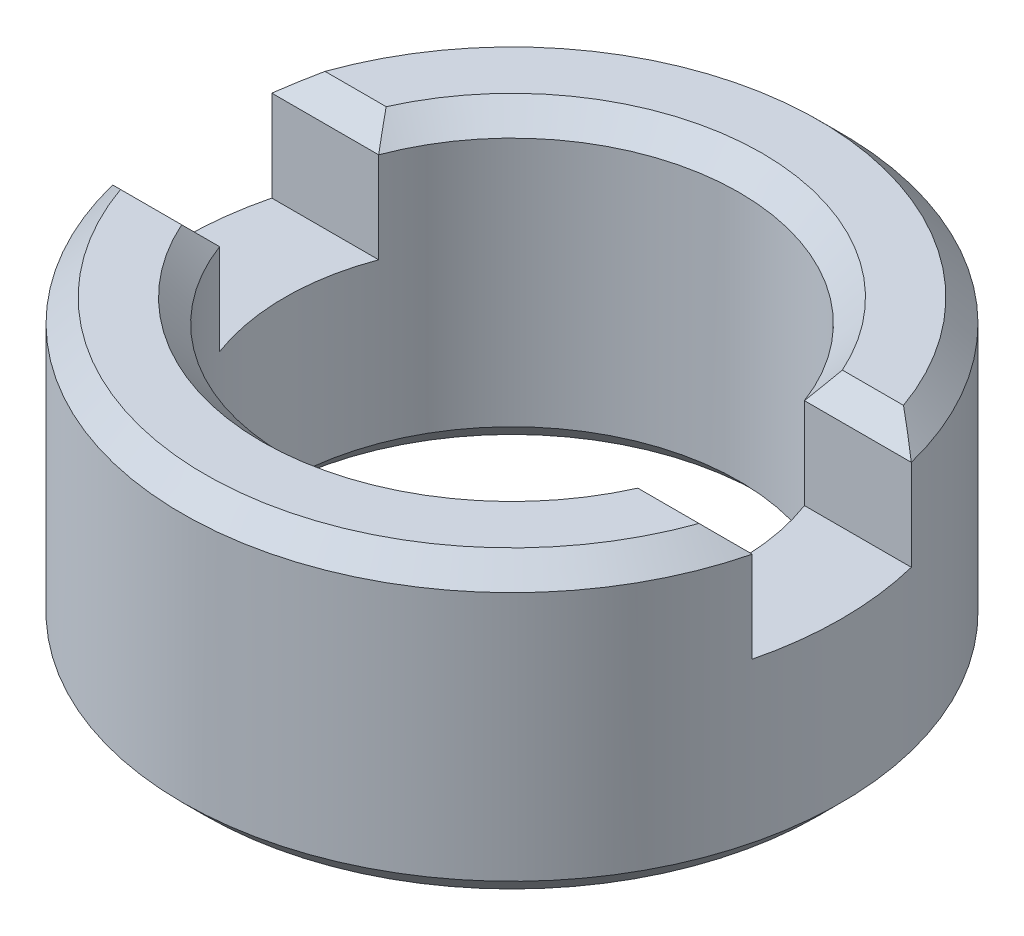
ISO-10303-21;
HEADER;
FILE_DESCRIPTION(('STEP AP214'),'2;1');
FILE_NAME('part.step','',(''),(''),'','','');
FILE_SCHEMA(('AUTOMOTIVE_DESIGN { 1 0 10303 214 1 1 1 1 }'));
ENDSEC;
DATA;
#1=APPLICATION_CONTEXT('core data for automotive mechanical design processes');
#2=APPLICATION_PROTOCOL_DEFINITION('international standard','automotive_design',2000,#1);
#3=PRODUCT_CONTEXT('',#1,'mechanical');
#4=PRODUCT('Part','Part','',(#3));
#5=PRODUCT_RELATED_PRODUCT_CATEGORY('part','',(#4));
#6=PRODUCT_DEFINITION_FORMATION('','',#4);
#7=PRODUCT_DEFINITION_CONTEXT('part definition',#1,'design');
#8=PRODUCT_DEFINITION('design','',#6,#7);
#9=PRODUCT_DEFINITION_SHAPE('','',#8);
#10=(LENGTH_UNIT() NAMED_UNIT(*) SI_UNIT(.MILLI.,.METRE.));
#11=(NAMED_UNIT(*) PLANE_ANGLE_UNIT() SI_UNIT($,.RADIAN.));
#12=(NAMED_UNIT(*) SI_UNIT($,.STERADIAN.) SOLID_ANGLE_UNIT());
#13=UNCERTAINTY_MEASURE_WITH_UNIT(LENGTH_MEASURE(1.E-05),#10,'distance_accuracy_value','');
#14=(GEOMETRIC_REPRESENTATION_CONTEXT(3) GLOBAL_UNCERTAINTY_ASSIGNED_CONTEXT((#13)) GLOBAL_UNIT_ASSIGNED_CONTEXT((#10,
#11,#12)) REPRESENTATION_CONTEXT('',''));
#15=CARTESIAN_POINT('',(0.,0.,0.));
#16=DIRECTION('',(0.,0.,1.));
#17=DIRECTION('',(1.,0.,0.));
#18=AXIS2_PLACEMENT_3D('',#15,#16,#17);
#19=CARTESIAN_POINT('',(0.,0.8255,0.));
#20=DIRECTION('',(0.,-1.,0.));
#21=DIRECTION('',(0.,0.,-1.));
#22=AXIS2_PLACEMENT_3D('',#19,#20,#21);
#23=CYLINDRICAL_SURFACE('',#22,1.8415);
#24=CARTESIAN_POINT('',(0.,-0.698500000000003,0.));
#25=DIRECTION('',(0.,1.,0.));
#26=DIRECTION('',(0.,0.,1.));
#27=AXIS2_PLACEMENT_3D('',#24,#25,#26);
#28=CIRCLE('',#27,1.8415);
#29=CARTESIAN_POINT('',(0.,-0.698500000000003,1.8415));
#30=VERTEX_POINT('',#29);
#31=EDGE_CURVE('E198',#30,#30,#28,.T.);
#32=ORIENTED_EDGE('',*,*,#31,.T.);
#33=EDGE_LOOP('',(#32));
#34=FACE_BOUND('',#33,.T.);
#35=DIRECTION('',(0.,1.,0.));
#36=VECTOR('',#35,1.);
#37=CARTESIAN_POINT('',(-1.78704840449273,0.1905,-0.4445));
#38=LINE('',#37,#36);
#39=CARTESIAN_POINT('',(-1.78704840449273,0.1905,-0.4445));
#40=VERTEX_POINT('',#39);
#41=CARTESIAN_POINT('',(-1.78704840449273,0.6985,-0.4445));
#42=VERTEX_POINT('',#41);
#43=EDGE_CURVE('E167',#40,#42,#38,.T.);
#44=ORIENTED_EDGE('',*,*,#43,.T.);
#45=CARTESIAN_POINT('',(0.,0.6985,0.));
#46=DIRECTION('',(0.,1.,0.));
#47=DIRECTION('',(0.,0.,1.));
#48=AXIS2_PLACEMENT_3D('',#45,#46,#47);
#49=CIRCLE('',#48,1.8415);
#50=CARTESIAN_POINT('',(1.78704840449273,0.6985,-0.4445));
#51=VERTEX_POINT('',#50);
#52=EDGE_CURVE('E196',#42,#51,#49,.F.);
#53=ORIENTED_EDGE('',*,*,#52,.T.);
#54=DIRECTION('',(0.,1.,0.));
#55=VECTOR('',#54,1.);
#56=CARTESIAN_POINT('',(1.78704840449273,0.1905,-0.4445));
#57=LINE('',#56,#55);
#58=CARTESIAN_POINT('',(1.78704840449273,0.1905,-0.4445));
#59=VERTEX_POINT('',#58);
#60=EDGE_CURVE('E184',#59,#51,#57,.T.);
#61=ORIENTED_EDGE('',*,*,#60,.F.);
#62=CARTESIAN_POINT('',(0.,0.1905,0.));
#63=DIRECTION('',(0.,-1.,0.));
#64=DIRECTION('',(0.,0.,-1.));
#65=AXIS2_PLACEMENT_3D('',#62,#63,#64);
#66=CIRCLE('',#65,1.8415);
#67=CARTESIAN_POINT('',(1.78704840449273,0.1905,0.4445));
#68=VERTEX_POINT('',#67);
#69=EDGE_CURVE('E169',#59,#68,#66,.T.);
#70=ORIENTED_EDGE('',*,*,#69,.T.);
#71=DIRECTION('',(0.,1.,0.));
#72=VECTOR('',#71,1.);
#73=CARTESIAN_POINT('',(1.78704840449273,0.1905,0.4445));
#74=LINE('',#73,#72);
#75=CARTESIAN_POINT('',(1.78704840449273,0.6985,0.4445));
#76=VERTEX_POINT('',#75);
#77=EDGE_CURVE('E193',#68,#76,#74,.T.);
#78=ORIENTED_EDGE('',*,*,#77,.T.);
#79=CARTESIAN_POINT('',(0.,0.6985,0.));
#80=DIRECTION('',(0.,1.,0.));
#81=DIRECTION('',(0.,0.,1.));
#82=AXIS2_PLACEMENT_3D('',#79,#80,#81);
#83=CIRCLE('',#82,1.8415);
#84=CARTESIAN_POINT('',(-1.78704840449273,0.6985,0.444500000000001));
#85=VERTEX_POINT('',#84);
#86=EDGE_CURVE('E166',#76,#85,#83,.F.);
#87=ORIENTED_EDGE('',*,*,#86,.T.);
#88=DIRECTION('',(0.,1.,0.));
#89=VECTOR('',#88,1.);
#90=CARTESIAN_POINT('',(-1.78704840449273,0.1905,0.444500000000001));
#91=LINE('',#90,#89);
#92=CARTESIAN_POINT('',(-1.78704840449273,0.1905,0.444500000000001));
#93=VERTEX_POINT('',#92);
#94=EDGE_CURVE('E147',#93,#85,#91,.T.);
#95=ORIENTED_EDGE('',*,*,#94,.F.);
#96=CARTESIAN_POINT('',(0.,0.1905,0.));
#97=DIRECTION('',(0.,-1.,0.));
#98=DIRECTION('',(0.,0.,-1.));
#99=AXIS2_PLACEMENT_3D('',#96,#97,#98);
#100=CIRCLE('',#99,1.8415);
#101=EDGE_CURVE('E154',#93,#40,#100,.T.);
#102=ORIENTED_EDGE('',*,*,#101,.T.);
#103=EDGE_LOOP('',(#44,#53,#61,#70,#78,#87,#95,#102));
#104=FACE_BOUND('',#103,.T.);
#105=ADVANCED_FACE('F46',(#34,#104),#23,.T.);
#106=CARTESIAN_POINT('',(0.,0.8255,0.));
#107=DIRECTION('',(0.,1.,0.));
#108=DIRECTION('',(0.,0.,1.));
#109=AXIS2_PLACEMENT_3D('',#106,#107,#108);
#110=PLANE('',#109);
#111=DIRECTION('',(-1.,0.,0.));
#112=VECTOR('',#111,1.);
#113=CARTESIAN_POINT('',(0.,0.8255,0.571500000000001));
#114=LINE('',#113,#112);
#115=CARTESIAN_POINT('',(1.61644610179247,0.8255,0.571499999999946));
#116=VERTEX_POINT('',#115);
#117=CARTESIAN_POINT('',(1.27475360364269,0.8255,0.571500000000001));
#118=VERTEX_POINT('',#117);
#119=EDGE_CURVE('E67',#116,#118,#114,.T.);
#120=ORIENTED_EDGE('',*,*,#119,.T.);
#121=CARTESIAN_POINT('',(0.,0.8255,0.));
#122=DIRECTION('',(0.,1.,0.));
#123=DIRECTION('',(0.,0.,1.));
#124=AXIS2_PLACEMENT_3D('',#121,#122,#123);
#125=CIRCLE('',#124,1.397);
#126=CARTESIAN_POINT('',(-1.27475360364269,0.8255,0.571500000000001));
#127=VERTEX_POINT('',#126);
#128=EDGE_CURVE('E234',#118,#127,#125,.F.);
#129=ORIENTED_EDGE('',*,*,#128,.T.);
#130=DIRECTION('',(-1.,0.,0.));
#131=VECTOR('',#130,1.);
#132=CARTESIAN_POINT('',(0.,0.8255,0.571500000000001));
#133=LINE('',#132,#131);
#134=CARTESIAN_POINT('',(-1.61644610179247,0.8255,0.571499999999946));
#135=VERTEX_POINT('',#134);
#136=EDGE_CURVE('E231',#127,#135,#133,.T.);
#137=ORIENTED_EDGE('',*,*,#136,.T.);
#138=CARTESIAN_POINT('',(0.,0.8255,0.));
#139=DIRECTION('',(0.,1.,0.));
#140=DIRECTION('',(0.,0.,1.));
#141=AXIS2_PLACEMENT_3D('',#138,#139,#140);
#142=CIRCLE('',#141,1.7145);
#143=EDGE_CURVE('E229',#135,#116,#142,.T.);
#144=ORIENTED_EDGE('',*,*,#143,.T.);
#145=EDGE_LOOP('',(#120,#129,#137,#144));
#146=FACE_BOUND('',#145,.T.);
#147=ADVANCED_FACE('F306',(#146),#110,.T.);
#148=DIRECTION('',(1.,0.,0.));
#149=VECTOR('',#148,1.);
#150=CARTESIAN_POINT('',(0.,0.8255,-0.571500000000001));
#151=LINE('',#150,#149);
#152=CARTESIAN_POINT('',(-1.61644610179247,0.8255,-0.571499999999946));
#153=VERTEX_POINT('',#152);
#154=CARTESIAN_POINT('',(-1.27475360364268,0.8255,-0.571500000000001));
#155=VERTEX_POINT('',#154);
#156=EDGE_CURVE('E218',#153,#155,#151,.T.);
#157=ORIENTED_EDGE('',*,*,#156,.T.);
#158=CARTESIAN_POINT('',(0.,0.8255,0.));
#159=DIRECTION('',(0.,1.,0.));
#160=DIRECTION('',(0.,0.,1.));
#161=AXIS2_PLACEMENT_3D('',#158,#159,#160);
#162=CIRCLE('',#161,1.397);
#163=CARTESIAN_POINT('',(1.27475360364268,0.8255,-0.571500000000001));
#164=VERTEX_POINT('',#163);
#165=EDGE_CURVE('E222',#155,#164,#162,.F.);
#166=ORIENTED_EDGE('',*,*,#165,.T.);
#167=DIRECTION('',(1.,0.,0.));
#168=VECTOR('',#167,1.);
#169=CARTESIAN_POINT('',(0.,0.8255,-0.571500000000001));
#170=LINE('',#169,#168);
#171=CARTESIAN_POINT('',(1.61644610179247,0.8255,-0.571499999999946));
#172=VERTEX_POINT('',#171);
#173=EDGE_CURVE('E220',#164,#172,#170,.T.);
#174=ORIENTED_EDGE('',*,*,#173,.T.);
#175=CARTESIAN_POINT('',(0.,0.8255,0.));
#176=DIRECTION('',(0.,1.,0.));
#177=DIRECTION('',(0.,0.,1.));
#178=AXIS2_PLACEMENT_3D('',#175,#176,#177);
#179=CIRCLE('',#178,1.7145);
#180=EDGE_CURVE('E216',#172,#153,#179,.T.);
#181=ORIENTED_EDGE('',*,*,#180,.T.);
#182=EDGE_LOOP('',(#157,#166,#174,#181));
#183=FACE_BOUND('',#182,.T.);
#184=ADVANCED_FACE('F312',(#183),#110,.T.);
#185=CARTESIAN_POINT('',(0.,0.8255,0.));
#186=DIRECTION('',(0.,-1.,0.));
#187=DIRECTION('',(0.,0.,-1.));
#188=AXIS2_PLACEMENT_3D('',#185,#186,#187);
#189=CYLINDRICAL_SURFACE('',#188,1.27);
#190=CARTESIAN_POINT('',(0.,-0.698500000000001,0.));
#191=DIRECTION('',(0.,1.,0.));
#192=DIRECTION('',(0.,0.,1.));
#193=AXIS2_PLACEMENT_3D('',#190,#191,#192);
#194=CIRCLE('',#193,1.27);
#195=CARTESIAN_POINT('',(0.,-0.698500000000001,1.27));
#196=VERTEX_POINT('',#195);
#197=EDGE_CURVE('E213',#196,#196,#194,.F.);
#198=ORIENTED_EDGE('',*,*,#197,.T.);
#199=EDGE_LOOP('',(#198));
#200=FACE_BOUND('',#199,.T.);
#201=DIRECTION('',(0.,1.,0.));
#202=VECTOR('',#201,1.);
#203=CARTESIAN_POINT('',(1.18967211869489,0.1905,-0.4445));
#204=LINE('',#203,#202);
#205=CARTESIAN_POINT('',(1.18967211869489,0.1905,-0.4445));
#206=VERTEX_POINT('',#205);
#207=CARTESIAN_POINT('',(1.18967211869489,0.6985,-0.4445));
#208=VERTEX_POINT('',#207);
#209=EDGE_CURVE('E187',#206,#208,#204,.T.);
#210=ORIENTED_EDGE('',*,*,#209,.T.);
#211=CARTESIAN_POINT('',(0.,0.6985,0.));
#212=DIRECTION('',(0.,1.,0.));
#213=DIRECTION('',(0.,0.,1.));
#214=AXIS2_PLACEMENT_3D('',#211,#212,#213);
#215=CIRCLE('',#214,1.27);
#216=CARTESIAN_POINT('',(-1.18967211869489,0.6985,-0.4445));
#217=VERTEX_POINT('',#216);
#218=EDGE_CURVE('E210',#208,#217,#215,.T.);
#219=ORIENTED_EDGE('',*,*,#218,.T.);
#220=DIRECTION('',(0.,1.,0.));
#221=VECTOR('',#220,1.);
#222=CARTESIAN_POINT('',(-1.18967211869489,0.1905,-0.4445));
#223=LINE('',#222,#221);
#224=CARTESIAN_POINT('',(-1.18967211869489,0.1905,-0.4445));
#225=VERTEX_POINT('',#224);
#226=EDGE_CURVE('E171',#225,#217,#223,.T.);
#227=ORIENTED_EDGE('',*,*,#226,.F.);
#228=CARTESIAN_POINT('',(0.,0.1905,0.));
#229=DIRECTION('',(0.,1.,0.));
#230=DIRECTION('',(0.,0.,-1.));
#231=AXIS2_PLACEMENT_3D('',#228,#229,#230);
#232=CIRCLE('',#231,1.27);
#233=CARTESIAN_POINT('',(-1.18967211869489,0.1905,0.4445));
#234=VERTEX_POINT('',#233);
#235=EDGE_CURVE('E155',#225,#234,#232,.T.);
#236=ORIENTED_EDGE('',*,*,#235,.T.);
#237=DIRECTION('',(0.,1.,0.));
#238=VECTOR('',#237,1.);
#239=CARTESIAN_POINT('',(-1.18967211869489,0.1905,0.4445));
#240=LINE('',#239,#238);
#241=CARTESIAN_POINT('',(-1.18967211869489,0.6985,0.4445));
#242=VERTEX_POINT('',#241);
#243=EDGE_CURVE('E150',#234,#242,#240,.T.);
#244=ORIENTED_EDGE('',*,*,#243,.T.);
#245=CARTESIAN_POINT('',(0.,0.6985,0.));
#246=DIRECTION('',(0.,1.,0.));
#247=DIRECTION('',(0.,0.,1.));
#248=AXIS2_PLACEMENT_3D('',#245,#246,#247);
#249=CIRCLE('',#248,1.27);
#250=CARTESIAN_POINT('',(1.18967211869489,0.6985,0.4445));
#251=VERTEX_POINT('',#250);
#252=EDGE_CURVE('E207',#242,#251,#249,.T.);
#253=ORIENTED_EDGE('',*,*,#252,.T.);
#254=DIRECTION('',(0.,1.,0.));
#255=VECTOR('',#254,1.);
#256=CARTESIAN_POINT('',(1.18967211869489,0.1905,0.4445));
#257=LINE('',#256,#255);
#258=CARTESIAN_POINT('',(1.18967211869489,0.1905,0.4445));
#259=VERTEX_POINT('',#258);
#260=EDGE_CURVE('E190',#259,#251,#257,.T.);
#261=ORIENTED_EDGE('',*,*,#260,.F.);
#262=CARTESIAN_POINT('',(0.,0.1905,0.));
#263=DIRECTION('',(0.,1.,0.));
#264=DIRECTION('',(0.,0.,-1.));
#265=AXIS2_PLACEMENT_3D('',#262,#263,#264);
#266=CIRCLE('',#265,1.27);
#267=EDGE_CURVE('E179',#259,#206,#266,.T.);
#268=ORIENTED_EDGE('',*,*,#267,.T.);
#269=EDGE_LOOP('',(#210,#219,#227,#236,#244,#253,#261,#268));
#270=FACE_BOUND('',#269,.T.);
#271=ADVANCED_FACE('F331',(#200,#270),#189,.F.);
#272=CARTESIAN_POINT('',(0.,-0.8255,0.));
#273=DIRECTION('',(0.,1.,0.));
#274=DIRECTION('',(0.,0.,1.));
#275=AXIS2_PLACEMENT_3D('',#272,#273,#274);
#276=PLANE('',#275);
#277=CARTESIAN_POINT('',(0.,-0.8255,0.));
#278=DIRECTION('',(0.,1.,0.));
#279=DIRECTION('',(0.,0.,1.));
#280=AXIS2_PLACEMENT_3D('',#277,#278,#279);
#281=CIRCLE('',#280,1.7145);
#282=CARTESIAN_POINT('',(0.,-0.8255,1.7145));
#283=VERTEX_POINT('',#282);
#284=EDGE_CURVE('E204',#283,#283,#281,.F.);
#285=ORIENTED_EDGE('',*,*,#284,.T.);
#286=EDGE_LOOP('',(#285));
#287=FACE_BOUND('',#286,.T.);
#288=CARTESIAN_POINT('',(0.,-0.8255,0.));
#289=DIRECTION('',(0.,1.,0.));
#290=DIRECTION('',(0.,0.,1.));
#291=AXIS2_PLACEMENT_3D('',#288,#289,#290);
#292=CIRCLE('',#291,1.397);
#293=CARTESIAN_POINT('',(0.,-0.8255,1.397));
#294=VERTEX_POINT('',#293);
#295=EDGE_CURVE('E201',#294,#294,#292,.T.);
#296=ORIENTED_EDGE('',*,*,#295,.T.);
#297=EDGE_LOOP('',(#296));
#298=FACE_BOUND('',#297,.T.);
#299=ADVANCED_FACE('F316',(#287,#298),#276,.F.);
#300=CARTESIAN_POINT('',(1.18967211869489,0.1905,0.4445));
#301=DIRECTION('',(0.,0.,-1.));
#302=DIRECTION('',(-1.,0.,0.));
#303=AXIS2_PLACEMENT_3D('',#300,#301,#302);
#304=PLANE('',#303);
#305=ORIENTED_EDGE('',*,*,#260,.T.);
#306=DIRECTION('',(1.,0.,0.));
#307=VECTOR('',#306,1.);
#308=CARTESIAN_POINT('',(1.18967211869489,0.6985,0.4445));
#309=LINE('',#308,#307);
#310=EDGE_CURVE('E59',#251,#76,#309,.T.);
#311=ORIENTED_EDGE('',*,*,#310,.T.);
#312=ORIENTED_EDGE('',*,*,#77,.F.);
#313=DIRECTION('',(-1.,0.,0.));
#314=VECTOR('',#313,1.);
#315=CARTESIAN_POINT('',(1.18967211869489,0.1905,0.4445));
#316=LINE('',#315,#314);
#317=EDGE_CURVE('E177',#68,#259,#316,.T.);
#318=ORIENTED_EDGE('',*,*,#317,.T.);
#319=EDGE_LOOP('',(#305,#311,#312,#318));
#320=FACE_BOUND('',#319,.T.);
#321=ADVANCED_FACE('F376',(#320),#304,.T.);
#322=CARTESIAN_POINT('',(1.18967211869489,0.1905,-0.4445));
#323=DIRECTION('',(0.,0.,1.));
#324=DIRECTION('',(1.,0.,0.));
#325=AXIS2_PLACEMENT_3D('',#322,#323,#324);
#326=PLANE('',#325);
#327=ORIENTED_EDGE('',*,*,#60,.T.);
#328=DIRECTION('',(-1.,0.,0.));
#329=VECTOR('',#328,1.);
#330=CARTESIAN_POINT('',(1.18967211869489,0.6985,-0.4445));
#331=LINE('',#330,#329);
#332=EDGE_CURVE('E225',#51,#208,#331,.T.);
#333=ORIENTED_EDGE('',*,*,#332,.T.);
#334=ORIENTED_EDGE('',*,*,#209,.F.);
#335=DIRECTION('',(1.,0.,0.));
#336=VECTOR('',#335,1.);
#337=CARTESIAN_POINT('',(1.18967211869489,0.1905,-0.4445));
#338=LINE('',#337,#336);
#339=EDGE_CURVE('E182',#206,#59,#338,.T.);
#340=ORIENTED_EDGE('',*,*,#339,.T.);
#341=EDGE_LOOP('',(#327,#333,#334,#340));
#342=FACE_BOUND('',#341,.T.);
#343=ADVANCED_FACE('F359',(#342),#326,.T.);
#344=CARTESIAN_POINT('',(0.,0.1905,0.));
#345=DIRECTION('',(0.,-1.,0.));
#346=DIRECTION('',(0.,0.,-1.));
#347=AXIS2_PLACEMENT_3D('',#344,#345,#346);
#348=PLANE('',#347);
#349=ORIENTED_EDGE('',*,*,#69,.F.);
#350=ORIENTED_EDGE('',*,*,#339,.F.);
#351=ORIENTED_EDGE('',*,*,#267,.F.);
#352=ORIENTED_EDGE('',*,*,#317,.F.);
#353=EDGE_LOOP('',(#349,#350,#351,#352));
#354=FACE_BOUND('',#353,.T.);
#355=ADVANCED_FACE('F362',(#354),#348,.F.);
#356=CARTESIAN_POINT('',(-1.78704840449273,0.1905,0.4445));
#357=DIRECTION('',(0.,0.,-1.));
#358=DIRECTION('',(-1.,0.,0.));
#359=AXIS2_PLACEMENT_3D('',#356,#357,#358);
#360=PLANE('',#359);
#361=ORIENTED_EDGE('',*,*,#94,.T.);
#362=DIRECTION('',(1.,0.,0.));
#363=VECTOR('',#362,1.);
#364=CARTESIAN_POINT('',(-1.78704840449273,0.6985,0.4445));
#365=LINE('',#364,#363);
#366=EDGE_CURVE('E13',#85,#242,#365,.T.);
#367=ORIENTED_EDGE('',*,*,#366,.T.);
#368=ORIENTED_EDGE('',*,*,#243,.F.);
#369=DIRECTION('',(-1.,0.,0.));
#370=VECTOR('',#369,1.);
#371=CARTESIAN_POINT('',(-1.78704840449273,0.1905,0.4445));
#372=LINE('',#371,#370);
#373=EDGE_CURVE('E143',#234,#93,#372,.T.);
#374=ORIENTED_EDGE('',*,*,#373,.T.);
#375=EDGE_LOOP('',(#361,#367,#368,#374));
#376=FACE_BOUND('',#375,.T.);
#377=ADVANCED_FACE('F145',(#376),#360,.T.);
#378=CARTESIAN_POINT('',(-1.78704840449273,0.1905,-0.4445));
#379=DIRECTION('',(0.,0.,1.));
#380=DIRECTION('',(1.,0.,0.));
#381=AXIS2_PLACEMENT_3D('',#378,#379,#380);
#382=PLANE('',#381);
#383=ORIENTED_EDGE('',*,*,#226,.T.);
#384=DIRECTION('',(-1.,0.,0.));
#385=VECTOR('',#384,1.);
#386=CARTESIAN_POINT('',(-1.78704840449273,0.6985,-0.4445));
#387=LINE('',#386,#385);
#388=EDGE_CURVE('E227',#217,#42,#387,.T.);
#389=ORIENTED_EDGE('',*,*,#388,.T.);
#390=ORIENTED_EDGE('',*,*,#43,.F.);
#391=DIRECTION('',(1.,0.,0.));
#392=VECTOR('',#391,1.);
#393=CARTESIAN_POINT('',(-1.78704840449273,0.1905,-0.4445));
#394=LINE('',#393,#392);
#395=EDGE_CURVE('E160',#40,#225,#394,.T.);
#396=ORIENTED_EDGE('',*,*,#395,.T.);
#397=EDGE_LOOP('',(#383,#389,#390,#396));
#398=FACE_BOUND('',#397,.T.);
#399=ADVANCED_FACE('F356',(#398),#382,.T.);
#400=CARTESIAN_POINT('',(0.,0.1905,0.));
#401=DIRECTION('',(0.,-1.,0.));
#402=DIRECTION('',(0.,0.,-1.));
#403=AXIS2_PLACEMENT_3D('',#400,#401,#402);
#404=PLANE('',#403);
#405=ORIENTED_EDGE('',*,*,#235,.F.);
#406=ORIENTED_EDGE('',*,*,#395,.F.);
#407=ORIENTED_EDGE('',*,*,#101,.F.);
#408=ORIENTED_EDGE('',*,*,#373,.F.);
#409=EDGE_LOOP('',(#405,#406,#407,#408));
#410=FACE_BOUND('',#409,.T.);
#411=ADVANCED_FACE('F159',(#410),#404,.F.);
#412=CARTESIAN_POINT('',(0.,-0.698500000000003,0.));
#413=DIRECTION('',(0.,1.,0.));
#414=DIRECTION('',(0.,0.,1.));
#415=AXIS2_PLACEMENT_3D('',#412,#413,#414);
#416=CONICAL_SURFACE('',#415,1.8415,0.785398163397447);
#417=ORIENTED_EDGE('',*,*,#284,.F.);
#418=EDGE_LOOP('',(#417));
#419=FACE_BOUND('',#418,.T.);
#420=ORIENTED_EDGE('',*,*,#31,.F.);
#421=EDGE_LOOP('',(#420));
#422=FACE_BOUND('',#421,.T.);
#423=ADVANCED_FACE('F317',(#419,#422),#416,.T.);
#424=CARTESIAN_POINT('',(0.,-0.698500000000001,0.));
#425=DIRECTION('',(0.,-1.,0.));
#426=DIRECTION('',(0.,0.,-1.));
#427=AXIS2_PLACEMENT_3D('',#424,#425,#426);
#428=CONICAL_SURFACE('',#427,1.27,0.785398163397447);
#429=ORIENTED_EDGE('',*,*,#295,.F.);
#430=EDGE_LOOP('',(#429));
#431=FACE_BOUND('',#430,.T.);
#432=ORIENTED_EDGE('',*,*,#197,.F.);
#433=EDGE_LOOP('',(#432));
#434=FACE_BOUND('',#433,.T.);
#435=ADVANCED_FACE('F319',(#431,#434),#428,.F.);
#436=CARTESIAN_POINT('',(0.,0.8255,0.));
#437=DIRECTION('',(0.,-1.,0.));
#438=DIRECTION('',(0.,0.,-1.));
#439=AXIS2_PLACEMENT_3D('',#436,#437,#438);
#440=CONICAL_SURFACE('',#439,1.7145,0.785398163397451);
#441=CARTESIAN_POINT('',(1.61644610179262,0.8255,-0.571500000000001));
#442=CARTESIAN_POINT('',(1.64562909622052,0.804836369439288,-0.550836369439289));
#443=CARTESIAN_POINT('',(1.67443752947388,0.783921160178126,-0.529921160178127));
#444=CARTESIAN_POINT('',(1.73130495532105,0.741587821212098,-0.487587821212099));
#445=CARTESIAN_POINT('',(1.75936395630106,0.720169697139929,-0.46616969713993));
#446=CARTESIAN_POINT('',(1.78704840449274,0.698500000000007,-0.444500000000007));
#447=B_SPLINE_CURVE_WITH_KNOTS('',3,(#441,#442,#443,#444,#445,#446),.UNSPECIFIED.,.F.,.F.,(4,2,
4),(0.,0.123868317379826,0.24773524808306),.UNSPECIFIED.);
#448=EDGE_CURVE('E274',#51,#172,#447,.F.);
#449=ORIENTED_EDGE('',*,*,#448,.F.);
#450=ORIENTED_EDGE('',*,*,#52,.F.);
#451=CARTESIAN_POINT('',(-1.78704840449273,0.6985,-0.4445));
#452=CARTESIAN_POINT('',(-1.75936395630107,0.720169697139936,-0.466169697139937));
#453=CARTESIAN_POINT('',(-1.73130495532106,0.741587821212108,-0.487587821212108));
#454=CARTESIAN_POINT('',(-1.67443752947387,0.783921160178119,-0.529921160178119));
#455=CARTESIAN_POINT('',(-1.64562909622047,0.804836369439261,-0.550836369439262));
#456=CARTESIAN_POINT('',(-1.61644610179253,0.825499999999942,-0.571499999999943));
#457=B_SPLINE_CURVE_WITH_KNOTS('',3,(#451,#452,#453,#454,#455,#456),.UNSPECIFIED.,.F.,.F.,(4,2,
4),(0.,0.123866930703236,0.247735248083065),.UNSPECIFIED.);
#458=EDGE_CURVE('E268',#153,#42,#457,.F.);
#459=ORIENTED_EDGE('',*,*,#458,.F.);
#460=ORIENTED_EDGE('',*,*,#180,.F.);
#461=EDGE_LOOP('',(#449,#450,#459,#460));
#462=FACE_BOUND('',#461,.T.);
#463=ADVANCED_FACE('F262',(#462),#440,.T.);
#464=CARTESIAN_POINT('',(0.,0.8255,-0.571500000000001));
#465=DIRECTION('',(0.,-0.707106781186549,-0.707106781186546));
#466=DIRECTION('',(1.,0.,0.));
#467=AXIS2_PLACEMENT_3D('',#464,#465,#466);
#468=PLANE('',#467);
#469=ORIENTED_EDGE('',*,*,#458,.T.);
#470=ORIENTED_EDGE('',*,*,#388,.F.);
#471=CARTESIAN_POINT('',(-1.18967211869489,0.6985,-0.4445));
#472=CARTESIAN_POINT('',(-1.20425215012869,0.719532807509362,-0.465532807509362));
#473=CARTESIAN_POINT('',(-1.21863230422864,0.740632567222454,-0.486632567222454));
#474=CARTESIAN_POINT('',(-1.24699279751285,0.782965901124688,-0.528965901124688));
#475=CARTESIAN_POINT('',(-1.26097313839555,0.804199474744908,-0.550199474744909));
#476=CARTESIAN_POINT('',(-1.27475360364285,0.825499999999938,-0.571499999999939));
#477=B_SPLINE_CURVE_WITH_KNOTS('',3,(#471,#472,#473,#474,#475,#476),.UNSPECIFIED.,.F.,.F.,(4,2,
4),(0.,0.0993715098332989,0.198742597464986),.UNSPECIFIED.);
#478=EDGE_CURVE('E244',#155,#217,#477,.F.);
#479=ORIENTED_EDGE('',*,*,#478,.F.);
#480=ORIENTED_EDGE('',*,*,#156,.F.);
#481=EDGE_LOOP('',(#469,#470,#479,#480));
#482=FACE_BOUND('',#481,.T.);
#483=ADVANCED_FACE('F257',(#482),#468,.F.);
#484=CARTESIAN_POINT('',(0.,0.8255,-0.571500000000001));
#485=DIRECTION('',(0.,-0.707106781186549,-0.707106781186546));
#486=DIRECTION('',(1.,0.,0.));
#487=AXIS2_PLACEMENT_3D('',#484,#485,#486);
#488=PLANE('',#487);
#489=ORIENTED_EDGE('',*,*,#448,.T.);
#490=ORIENTED_EDGE('',*,*,#173,.F.);
#491=CARTESIAN_POINT('',(1.27475360364268,0.8255,-0.571499999999992));
#492=CARTESIAN_POINT('',(1.26097313839545,0.804199474744946,-0.550199474744942));
#493=CARTESIAN_POINT('',(1.24699279751281,0.782965901124704,-0.528965901124704));
#494=CARTESIAN_POINT('',(1.21863230422869,0.74063256722244,-0.486632567222442));
#495=CARTESIAN_POINT('',(1.20425215012877,0.719532807509337,-0.465532807509339));
#496=CARTESIAN_POINT('',(1.18967211869499,0.698499999999969,-0.444499999999969));
#497=B_SPLINE_CURVE_WITH_KNOTS('',3,(#491,#492,#493,#494,#495,#496),.UNSPECIFIED.,.F.,.F.,(4,2,
4),(0.,0.0993710876316886,0.198742597464988),.UNSPECIFIED.);
#498=EDGE_CURVE('E237',#208,#164,#497,.F.);
#499=ORIENTED_EDGE('',*,*,#498,.F.);
#500=ORIENTED_EDGE('',*,*,#332,.F.);
#501=EDGE_LOOP('',(#489,#490,#499,#500));
#502=FACE_BOUND('',#501,.T.);
#503=ADVANCED_FACE('F250',(#502),#488,.F.);
#504=CARTESIAN_POINT('',(0.,0.8255,0.));
#505=DIRECTION('',(0.,1.,0.));
#506=DIRECTION('',(0.,0.,1.));
#507=AXIS2_PLACEMENT_3D('',#504,#505,#506);
#508=CONICAL_SURFACE('',#507,1.397,0.785398163397451);
#509=ORIENTED_EDGE('',*,*,#478,.T.);
#510=ORIENTED_EDGE('',*,*,#218,.F.);
#511=ORIENTED_EDGE('',*,*,#498,.T.);
#512=ORIENTED_EDGE('',*,*,#165,.F.);
#513=EDGE_LOOP('',(#509,#510,#511,#512));
#514=FACE_BOUND('',#513,.T.);
#515=ADVANCED_FACE('F253',(#514),#508,.F.);
#516=CARTESIAN_POINT('',(0.,0.8255,0.));
#517=DIRECTION('',(0.,-1.,0.));
#518=DIRECTION('',(0.,0.,-1.));
#519=AXIS2_PLACEMENT_3D('',#516,#517,#518);
#520=CONICAL_SURFACE('',#519,1.7145,0.785398163397451);
#521=CARTESIAN_POINT('',(-1.61644610179262,0.8255,0.571500000000001));
#522=CARTESIAN_POINT('',(-1.64562909622052,0.804836369439288,0.550836369439289));
#523=CARTESIAN_POINT('',(-1.67443752947388,0.783921160178126,0.529921160178127));
#524=CARTESIAN_POINT('',(-1.73130495532105,0.741587821212098,0.487587821212099));
#525=CARTESIAN_POINT('',(-1.75936395630106,0.720169697139929,0.46616969713993));
#526=CARTESIAN_POINT('',(-1.78704840449274,0.698500000000007,0.444500000000007));
#527=B_SPLINE_CURVE_WITH_KNOTS('',3,(#521,#522,#523,#524,#525,#526),.UNSPECIFIED.,.F.,.F.,(4,2,
4),(0.,0.123868317379826,0.247735248083059),.UNSPECIFIED.);
#528=EDGE_CURVE('E368',#85,#135,#527,.F.);
#529=ORIENTED_EDGE('',*,*,#528,.F.);
#530=ORIENTED_EDGE('',*,*,#86,.F.);
#531=CARTESIAN_POINT('',(1.78704840449273,0.6985,0.4445));
#532=CARTESIAN_POINT('',(1.75936395630107,0.720169697139936,0.466169697139937));
#533=CARTESIAN_POINT('',(1.73130495532106,0.741587821212108,0.487587821212108));
#534=CARTESIAN_POINT('',(1.67443752947387,0.783921160178119,0.529921160178119));
#535=CARTESIAN_POINT('',(1.64562909622047,0.804836369439261,0.550836369439262));
#536=CARTESIAN_POINT('',(1.61644610179253,0.825499999999942,0.571499999999943));
#537=B_SPLINE_CURVE_WITH_KNOTS('',3,(#531,#532,#533,#534,#535,#536),.UNSPECIFIED.,.F.,.F.,(4,2,
4),(0.,0.123866930703236,0.247735248083065),.UNSPECIFIED.);
#538=EDGE_CURVE('E51',#116,#76,#537,.F.);
#539=ORIENTED_EDGE('',*,*,#538,.F.);
#540=ORIENTED_EDGE('',*,*,#143,.F.);
#541=EDGE_LOOP('',(#529,#530,#539,#540));
#542=FACE_BOUND('',#541,.T.);
#543=ADVANCED_FACE('F48',(#542),#520,.T.);
#544=CARTESIAN_POINT('',(0.,0.8255,0.571500000000001));
#545=DIRECTION('',(0.,-0.707106781186549,0.707106781186546));
#546=DIRECTION('',(-1.,0.,0.));
#547=AXIS2_PLACEMENT_3D('',#544,#545,#546);
#548=PLANE('',#547);
#549=ORIENTED_EDGE('',*,*,#538,.T.);
#550=ORIENTED_EDGE('',*,*,#310,.F.);
#551=CARTESIAN_POINT('',(1.18967211869489,0.6985,0.4445));
#552=CARTESIAN_POINT('',(1.20425215012869,0.719532807509362,0.465532807509363));
#553=CARTESIAN_POINT('',(1.21863230422864,0.740632567222454,0.486632567222455));
#554=CARTESIAN_POINT('',(1.24699279751285,0.782965901124688,0.528965901124688));
#555=CARTESIAN_POINT('',(1.26097313839555,0.804199474744908,0.550199474744909));
#556=CARTESIAN_POINT('',(1.27475360364285,0.825499999999938,0.571499999999939));
#557=B_SPLINE_CURVE_WITH_KNOTS('',3,(#551,#552,#553,#554,#555,#556),.UNSPECIFIED.,.F.,.F.,(4,2,
4),(0.,0.0993715098332991,0.198742597464986),.UNSPECIFIED.);
#558=EDGE_CURVE('E283',#118,#251,#557,.F.);
#559=ORIENTED_EDGE('',*,*,#558,.F.);
#560=ORIENTED_EDGE('',*,*,#119,.F.);
#561=EDGE_LOOP('',(#549,#550,#559,#560));
#562=FACE_BOUND('',#561,.T.);
#563=ADVANCED_FACE('F292',(#562),#548,.F.);
#564=CARTESIAN_POINT('',(0.,0.8255,0.571500000000001));
#565=DIRECTION('',(0.,-0.707106781186549,0.707106781186546));
#566=DIRECTION('',(-1.,0.,0.));
#567=AXIS2_PLACEMENT_3D('',#564,#565,#566);
#568=PLANE('',#567);
#569=ORIENTED_EDGE('',*,*,#528,.T.);
#570=ORIENTED_EDGE('',*,*,#136,.F.);
#571=CARTESIAN_POINT('',(-1.27475360364269,0.8255,0.571499999999992));
#572=CARTESIAN_POINT('',(-1.26097313839546,0.804199474744946,0.550199474744942));
#573=CARTESIAN_POINT('',(-1.24699279751281,0.782965901124704,0.528965901124704));
#574=CARTESIAN_POINT('',(-1.21863230422869,0.74063256722244,0.486632567222442));
#575=CARTESIAN_POINT('',(-1.20425215012877,0.719532807509337,0.465532807509339));
#576=CARTESIAN_POINT('',(-1.18967211869499,0.698499999999969,0.444499999999969));
#577=B_SPLINE_CURVE_WITH_KNOTS('',3,(#571,#572,#573,#574,#575,#576),.UNSPECIFIED.,.F.,.F.,(4,2,
4),(0.,0.0993710876316887,0.198742597464988),.UNSPECIFIED.);
#578=EDGE_CURVE('E75',#242,#127,#577,.F.);
#579=ORIENTED_EDGE('',*,*,#578,.F.);
#580=ORIENTED_EDGE('',*,*,#366,.F.);
#581=EDGE_LOOP('',(#569,#570,#579,#580));
#582=FACE_BOUND('',#581,.T.);
#583=ADVANCED_FACE('F287',(#582),#568,.F.);
#584=CARTESIAN_POINT('',(0.,0.8255,0.));
#585=DIRECTION('',(0.,1.,0.));
#586=DIRECTION('',(0.,0.,1.));
#587=AXIS2_PLACEMENT_3D('',#584,#585,#586);
#588=CONICAL_SURFACE('',#587,1.397,0.785398163397451);
#589=ORIENTED_EDGE('',*,*,#558,.T.);
#590=ORIENTED_EDGE('',*,*,#252,.F.);
#591=ORIENTED_EDGE('',*,*,#578,.T.);
#592=ORIENTED_EDGE('',*,*,#128,.F.);
#593=EDGE_LOOP('',(#589,#590,#591,#592));
#594=FACE_BOUND('',#593,.T.);
#595=ADVANCED_FACE('F289',(#594),#588,.F.);
#596=CLOSED_SHELL('',(#105,#147,#184,#271,#299,#321,#343,#355,#377,#399,#411,#423,#435,#463,
#483,#503,#515,#543,#563,#583,#595));
#597=MANIFOLD_SOLID_BREP('B2',#596);
#598=ADVANCED_BREP_SHAPE_REPRESENTATION('',(#18,#597),#14);
#599=SHAPE_DEFINITION_REPRESENTATION(#9,#598);
ENDSEC;
END-ISO-10303-21;
